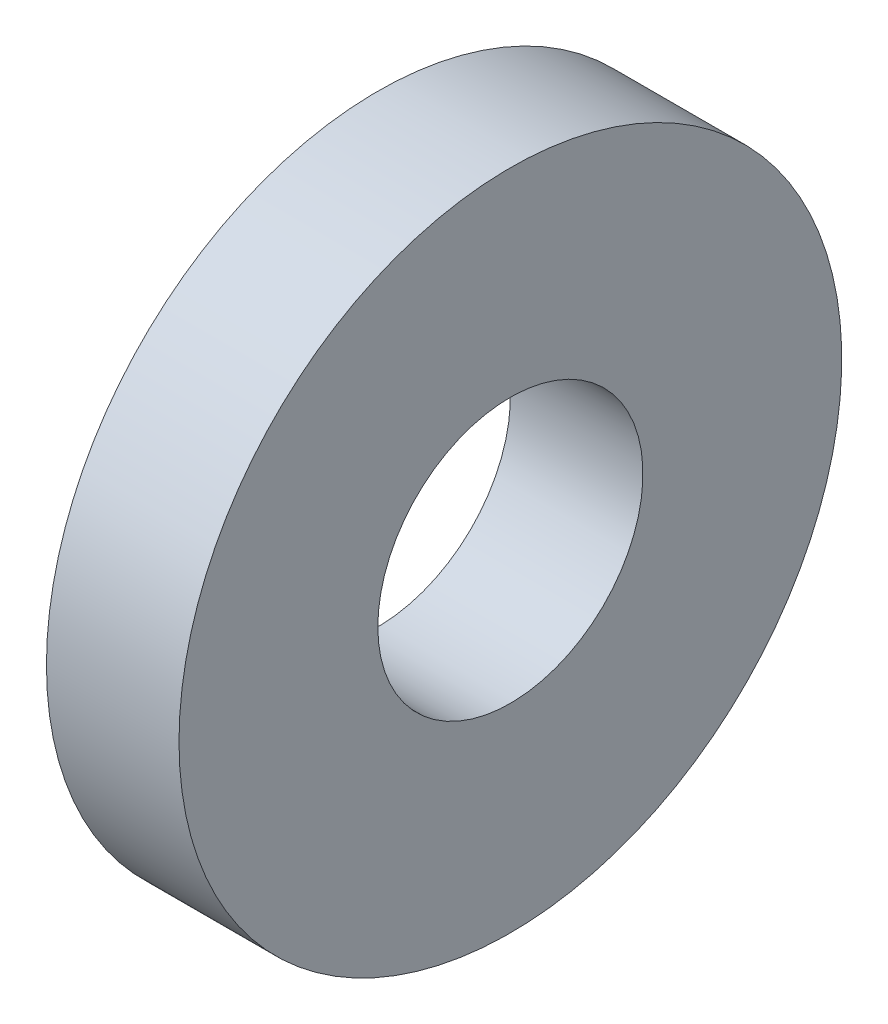
ISO-10303-21;
HEADER;
FILE_DESCRIPTION(('STEP AP214'),'2;1');
FILE_NAME('part.step','',(''),(''),'','','');
FILE_SCHEMA(('AUTOMOTIVE_DESIGN { 1 0 10303 214 1 1 1 1 }'));
ENDSEC;
DATA;
#1=APPLICATION_CONTEXT('core data for automotive mechanical design processes');
#2=APPLICATION_PROTOCOL_DEFINITION('international standard','automotive_design',2000,#1);
#3=PRODUCT_CONTEXT('',#1,'mechanical');
#4=PRODUCT('Part','Part','',(#3));
#5=PRODUCT_RELATED_PRODUCT_CATEGORY('part','',(#4));
#6=PRODUCT_DEFINITION_FORMATION('','',#4);
#7=PRODUCT_DEFINITION_CONTEXT('part definition',#1,'design');
#8=PRODUCT_DEFINITION('design','',#6,#7);
#9=PRODUCT_DEFINITION_SHAPE('','',#8);
#10=(LENGTH_UNIT() NAMED_UNIT(*) SI_UNIT(.MILLI.,.METRE.));
#11=(NAMED_UNIT(*) PLANE_ANGLE_UNIT() SI_UNIT($,.RADIAN.));
#12=(NAMED_UNIT(*) SI_UNIT($,.STERADIAN.) SOLID_ANGLE_UNIT());
#13=UNCERTAINTY_MEASURE_WITH_UNIT(LENGTH_MEASURE(1.E-05),#10,'distance_accuracy_value','');
#14=(GEOMETRIC_REPRESENTATION_CONTEXT(3) GLOBAL_UNCERTAINTY_ASSIGNED_CONTEXT((#13)) GLOBAL_UNIT_ASSIGNED_CONTEXT((#10,
#11,#12)) REPRESENTATION_CONTEXT('',''));
#15=CARTESIAN_POINT('',(0.,0.,0.));
#16=DIRECTION('',(0.,0.,1.));
#17=DIRECTION('',(1.,0.,0.));
#18=AXIS2_PLACEMENT_3D('',#15,#16,#17);
#19=CARTESIAN_POINT('',(-2.5,12.5,0.));
#20=DIRECTION('',(1.,0.,0.));
#21=DIRECTION('',(0.,0.,-1.));
#22=AXIS2_PLACEMENT_3D('',#19,#20,#21);
#23=PLANE('',#22);
#24=CARTESIAN_POINT('',(-2.5,0.,0.));
#25=DIRECTION('',(-1.,0.,0.));
#26=DIRECTION('',(0.,0.,1.));
#27=AXIS2_PLACEMENT_3D('',#24,#25,#26);
#28=CIRCLE('',#27,5.);
#29=CARTESIAN_POINT('',(-2.5,0.,5.));
#30=VERTEX_POINT('',#29);
#31=EDGE_CURVE('E51',#30,#30,#28,.T.);
#32=ORIENTED_EDGE('',*,*,#31,.F.);
#33=EDGE_LOOP('',(#32));
#34=FACE_BOUND('',#33,.T.);
#35=CARTESIAN_POINT('',(-2.5,0.,0.));
#36=DIRECTION('',(-1.,0.,0.));
#37=DIRECTION('',(0.,0.,1.));
#38=AXIS2_PLACEMENT_3D('',#35,#36,#37);
#39=CIRCLE('',#38,12.5);
#40=CARTESIAN_POINT('',(-2.5,0.,12.5));
#41=VERTEX_POINT('',#40);
#42=EDGE_CURVE('E10',#41,#41,#39,.T.);
#43=ORIENTED_EDGE('',*,*,#42,.T.);
#44=EDGE_LOOP('',(#43));
#45=FACE_BOUND('',#44,.T.);
#46=ADVANCED_FACE('F37',(#34,#45),#23,.F.);
#47=CARTESIAN_POINT('',(0.,0.,0.));
#48=DIRECTION('',(-1.,0.,0.));
#49=DIRECTION('',(0.,0.,1.));
#50=AXIS2_PLACEMENT_3D('',#47,#48,#49);
#51=CYLINDRICAL_SURFACE('',#50,12.5);
#52=ORIENTED_EDGE('',*,*,#42,.F.);
#53=EDGE_LOOP('',(#52));
#54=FACE_BOUND('',#53,.T.);
#55=CARTESIAN_POINT('',(2.5,0.,0.));
#56=DIRECTION('',(-1.,0.,0.));
#57=DIRECTION('',(0.,0.,1.));
#58=AXIS2_PLACEMENT_3D('',#55,#56,#57);
#59=CIRCLE('',#58,12.5);
#60=CARTESIAN_POINT('',(2.5,0.,12.5));
#61=VERTEX_POINT('',#60);
#62=EDGE_CURVE('E43',#61,#61,#59,.T.);
#63=ORIENTED_EDGE('',*,*,#62,.T.);
#64=EDGE_LOOP('',(#63));
#65=FACE_BOUND('',#64,.T.);
#66=ADVANCED_FACE('F60',(#54,#65),#51,.T.);
#67=CARTESIAN_POINT('',(2.5,12.5,0.));
#68=DIRECTION('',(-1.,0.,0.));
#69=DIRECTION('',(0.,0.,1.));
#70=AXIS2_PLACEMENT_3D('',#67,#68,#69);
#71=PLANE('',#70);
#72=ORIENTED_EDGE('',*,*,#62,.F.);
#73=EDGE_LOOP('',(#72));
#74=FACE_BOUND('',#73,.T.);
#75=CARTESIAN_POINT('',(2.5,0.,0.));
#76=DIRECTION('',(-1.,0.,0.));
#77=DIRECTION('',(0.,0.,1.));
#78=AXIS2_PLACEMENT_3D('',#75,#76,#77);
#79=CIRCLE('',#78,5.);
#80=CARTESIAN_POINT('',(2.5,0.,5.));
#81=VERTEX_POINT('',#80);
#82=EDGE_CURVE('E47',#81,#81,#79,.T.);
#83=ORIENTED_EDGE('',*,*,#82,.T.);
#84=EDGE_LOOP('',(#83));
#85=FACE_BOUND('',#84,.T.);
#86=ADVANCED_FACE('F64',(#74,#85),#71,.F.);
#87=CARTESIAN_POINT('',(0.,0.,0.));
#88=DIRECTION('',(-1.,0.,0.));
#89=DIRECTION('',(0.,0.,1.));
#90=AXIS2_PLACEMENT_3D('',#87,#88,#89);
#91=CYLINDRICAL_SURFACE('',#90,5.);
#92=ORIENTED_EDGE('',*,*,#82,.F.);
#93=EDGE_LOOP('',(#92));
#94=FACE_BOUND('',#93,.T.);
#95=ORIENTED_EDGE('',*,*,#31,.T.);
#96=EDGE_LOOP('',(#95));
#97=FACE_BOUND('',#96,.T.);
#98=ADVANCED_FACE('F57',(#94,#97),#91,.F.);
#99=CLOSED_SHELL('',(#46,#66,#86,#98));
#100=MANIFOLD_SOLID_BREP('B2',#99);
#101=ADVANCED_BREP_SHAPE_REPRESENTATION('',(#18,#100),#14);
#102=SHAPE_DEFINITION_REPRESENTATION(#9,#101);
ENDSEC;
END-ISO-10303-21;
